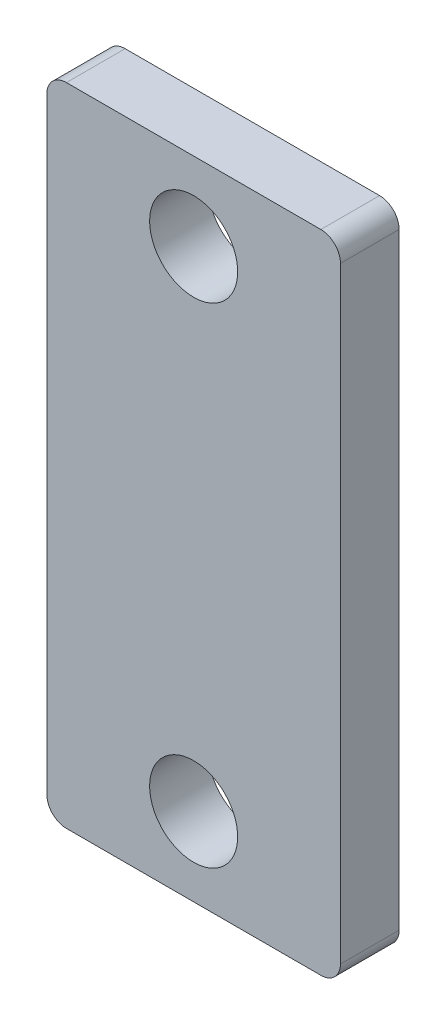
ISO-10303-21;
HEADER;
FILE_DESCRIPTION(('STEP AP214'),'2;1');
FILE_NAME('part.step','',(''),(''),'','','');
FILE_SCHEMA(('AUTOMOTIVE_DESIGN { 1 0 10303 214 1 1 1 1 }'));
ENDSEC;
DATA;
#1=APPLICATION_CONTEXT('core data for automotive mechanical design processes');
#2=APPLICATION_PROTOCOL_DEFINITION('international standard','automotive_design',2000,#1);
#3=PRODUCT_CONTEXT('',#1,'mechanical');
#4=PRODUCT('Part','Part','',(#3));
#5=PRODUCT_RELATED_PRODUCT_CATEGORY('part','',(#4));
#6=PRODUCT_DEFINITION_FORMATION('','',#4);
#7=PRODUCT_DEFINITION_CONTEXT('part definition',#1,'design');
#8=PRODUCT_DEFINITION('design','',#6,#7);
#9=PRODUCT_DEFINITION_SHAPE('','',#8);
#10=(LENGTH_UNIT() NAMED_UNIT(*) SI_UNIT(.MILLI.,.METRE.));
#11=(NAMED_UNIT(*) PLANE_ANGLE_UNIT() SI_UNIT($,.RADIAN.));
#12=(NAMED_UNIT(*) SI_UNIT($,.STERADIAN.) SOLID_ANGLE_UNIT());
#13=UNCERTAINTY_MEASURE_WITH_UNIT(LENGTH_MEASURE(1.E-05),#10,'distance_accuracy_value','');
#14=(GEOMETRIC_REPRESENTATION_CONTEXT(3) GLOBAL_UNCERTAINTY_ASSIGNED_CONTEXT((#13)) GLOBAL_UNIT_ASSIGNED_CONTEXT((#10,
#11,#12)) REPRESENTATION_CONTEXT('',''));
#15=CARTESIAN_POINT('',(0.,0.,0.));
#16=DIRECTION('',(0.,0.,1.));
#17=DIRECTION('',(1.,0.,0.));
#18=AXIS2_PLACEMENT_3D('',#15,#16,#17);
#19=CARTESIAN_POINT('',(0.,41.677288470691,-2.5));
#20=DIRECTION('',(0.,0.,-1.));
#21=DIRECTION('',(-1.,0.,0.));
#22=AXIS2_PLACEMENT_3D('',#19,#20,#21);
#23=PLANE('',#22);
#24=CARTESIAN_POINT('',(0.,41.677288470691,-2.49999999999773));
#25=DIRECTION('',(0.,0.,1.));
#26=DIRECTION('',(1.,0.,0.));
#27=AXIS2_PLACEMENT_3D('',#24,#25,#26);
#28=CIRCLE('',#27,0.749999999982264);
#29=CARTESIAN_POINT('',(0.749999999982265,41.677288470691,-2.49999999999773));
#30=VERTEX_POINT('',#29);
#31=EDGE_CURVE('E277',#30,#30,#28,.T.);
#32=ORIENTED_EDGE('',*,*,#31,.F.);
#33=EDGE_LOOP('',(#32));
#34=FACE_BOUND('',#33,.T.);
#35=ADVANCED_FACE('F16',(#34),#23,.T.);
#36=CARTESIAN_POINT('',(0.,29.677288470691,-2.5));
#37=DIRECTION('',(0.,0.,-1.));
#38=DIRECTION('',(-1.,0.,0.));
#39=AXIS2_PLACEMENT_3D('',#36,#37,#38);
#40=PLANE('',#39);
#41=CARTESIAN_POINT('',(0.,29.677288470691,-2.49999999999773));
#42=DIRECTION('',(0.,0.,1.));
#43=DIRECTION('',(1.,0.,0.));
#44=AXIS2_PLACEMENT_3D('',#41,#42,#43);
#45=CIRCLE('',#44,0.749999999925421);
#46=CARTESIAN_POINT('',(0.749999999925421,29.677288470691,-2.49999999999773));
#47=VERTEX_POINT('',#46);
#48=EDGE_CURVE('E273',#47,#47,#45,.T.);
#49=ORIENTED_EDGE('',*,*,#48,.F.);
#50=EDGE_LOOP('',(#49));
#51=FACE_BOUND('',#50,.T.);
#52=ADVANCED_FACE('F285',(#51),#40,.T.);
#53=CARTESIAN_POINT('',(0.,41.677288470691,-2.25000000011732));
#54=DIRECTION('',(0.,0.,1.));
#55=DIRECTION('',(1.,0.,0.));
#56=AXIS2_PLACEMENT_3D('',#53,#54,#55);
#57=CONICAL_SURFACE('',#56,0.999999999862665,0.785398163397448);
#58=CARTESIAN_POINT('',(0.,41.677288470691,-2.25));
#59=DIRECTION('',(0.,0.,1.));
#60=DIRECTION('',(1.,0.,0.));
#61=AXIS2_PLACEMENT_3D('',#58,#59,#60);
#62=CIRCLE('',#61,1.);
#63=CARTESIAN_POINT('',(1.,41.677288470691,-2.25));
#64=VERTEX_POINT('',#63);
#65=EDGE_CURVE('E276',#64,#64,#62,.T.);
#66=ORIENTED_EDGE('',*,*,#65,.F.);
#67=EDGE_LOOP('',(#66));
#68=FACE_BOUND('',#67,.T.);
#69=ORIENTED_EDGE('',*,*,#31,.T.);
#70=EDGE_LOOP('',(#69));
#71=FACE_BOUND('',#70,.T.);
#72=ADVANCED_FACE('F282',(#68,#71),#57,.T.);
#73=CARTESIAN_POINT('',(0.,29.677288470691,-2.25000000006048));
#74=DIRECTION('',(0.,0.,1.));
#75=DIRECTION('',(1.,0.,0.));
#76=AXIS2_PLACEMENT_3D('',#73,#74,#75);
#77=CONICAL_SURFACE('',#76,0.999999999862665,0.785398163397448);
#78=CARTESIAN_POINT('',(0.,29.677288470691,-2.25));
#79=DIRECTION('',(0.,0.,1.));
#80=DIRECTION('',(1.,0.,0.));
#81=AXIS2_PLACEMENT_3D('',#78,#79,#80);
#82=CIRCLE('',#81,1.);
#83=CARTESIAN_POINT('',(1.,29.677288470691,-2.25));
#84=VERTEX_POINT('',#83);
#85=EDGE_CURVE('E481',#84,#84,#82,.T.);
#86=ORIENTED_EDGE('',*,*,#85,.F.);
#87=EDGE_LOOP('',(#86));
#88=FACE_BOUND('',#87,.T.);
#89=ORIENTED_EDGE('',*,*,#48,.T.);
#90=EDGE_LOOP('',(#89));
#91=FACE_BOUND('',#90,.T.);
#92=ADVANCED_FACE('F364',(#88,#91),#77,.T.);
#93=CARTESIAN_POINT('',(0.,41.677288470691,-2.5));
#94=DIRECTION('',(0.,0.,1.));
#95=DIRECTION('',(1.,0.,0.));
#96=AXIS2_PLACEMENT_3D('',#93,#94,#95);
#97=CYLINDRICAL_SURFACE('',#96,1.);
#98=CARTESIAN_POINT('',(0.,41.677288470691,-0.5));
#99=DIRECTION('',(0.,0.,1.));
#100=DIRECTION('',(1.,0.,0.));
#101=AXIS2_PLACEMENT_3D('',#98,#99,#100);
#102=CIRCLE('',#101,1.);
#103=CARTESIAN_POINT('',(1.,41.677288470691,-0.5));
#104=VERTEX_POINT('',#103);
#105=EDGE_CURVE('E485',#104,#104,#102,.F.);
#106=ORIENTED_EDGE('',*,*,#105,.T.);
#107=EDGE_LOOP('',(#106));
#108=FACE_BOUND('',#107,.T.);
#109=ORIENTED_EDGE('',*,*,#65,.T.);
#110=EDGE_LOOP('',(#109));
#111=FACE_BOUND('',#110,.T.);
#112=ADVANCED_FACE('F357',(#108,#111),#97,.T.);
#113=CARTESIAN_POINT('',(0.,29.677288470691,-2.5));
#114=DIRECTION('',(0.,0.,1.));
#115=DIRECTION('',(1.,0.,0.));
#116=AXIS2_PLACEMENT_3D('',#113,#114,#115);
#117=CYLINDRICAL_SURFACE('',#116,1.);
#118=CARTESIAN_POINT('',(0.,29.677288470691,-0.5));
#119=DIRECTION('',(0.,0.,1.));
#120=DIRECTION('',(1.,0.,0.));
#121=AXIS2_PLACEMENT_3D('',#118,#119,#120);
#122=CIRCLE('',#121,1.);
#123=CARTESIAN_POINT('',(1.,29.677288470691,-0.5));
#124=VERTEX_POINT('',#123);
#125=EDGE_CURVE('E272',#124,#124,#122,.F.);
#126=ORIENTED_EDGE('',*,*,#125,.T.);
#127=EDGE_LOOP('',(#126));
#128=FACE_BOUND('',#127,.T.);
#129=ORIENTED_EDGE('',*,*,#85,.T.);
#130=EDGE_LOOP('',(#129));
#131=FACE_BOUND('',#130,.T.);
#132=ADVANCED_FACE('F351',(#128,#131),#117,.T.);
#133=CARTESIAN_POINT('',(0.,41.677288470691,-0.5));
#134=DIRECTION('',(0.,0.,1.));
#135=DIRECTION('',(1.,0.,0.));
#136=AXIS2_PLACEMENT_3D('',#133,#134,#135);
#137=TOROIDAL_SURFACE('',#136,1.5,0.5);
#138=CARTESIAN_POINT('',(0.,41.677288470691,0.));
#139=DIRECTION('',(0.,0.,-1.));
#140=DIRECTION('',(-1.,0.,0.));
#141=AXIS2_PLACEMENT_3D('',#138,#139,#140);
#142=CIRCLE('',#141,1.5);
#143=CARTESIAN_POINT('',(-1.5,41.677288470691,0.));
#144=VERTEX_POINT('',#143);
#145=CARTESIAN_POINT('',(1.5,41.677288470691,0.));
#146=VERTEX_POINT('',#145);
#147=EDGE_CURVE('E247',#144,#146,#142,.T.);
#148=ORIENTED_EDGE('',*,*,#147,.T.);
#149=CARTESIAN_POINT('',(0.,41.677288470691,0.));
#150=DIRECTION('',(0.,0.,-1.));
#151=DIRECTION('',(1.,0.,0.));
#152=AXIS2_PLACEMENT_3D('',#149,#150,#151);
#153=CIRCLE('',#152,1.5);
#154=EDGE_CURVE('E95',#146,#144,#153,.T.);
#155=ORIENTED_EDGE('',*,*,#154,.T.);
#156=EDGE_LOOP('',(#148,#155));
#157=FACE_BOUND('',#156,.T.);
#158=ORIENTED_EDGE('',*,*,#105,.F.);
#159=EDGE_LOOP('',(#158));
#160=FACE_BOUND('',#159,.T.);
#161=ADVANCED_FACE('F223',(#157,#160),#137,.F.);
#162=CARTESIAN_POINT('',(0.,29.677288470691,-0.5));
#163=DIRECTION('',(0.,0.,1.));
#164=DIRECTION('',(1.,0.,0.));
#165=AXIS2_PLACEMENT_3D('',#162,#163,#164);
#166=TOROIDAL_SURFACE('',#165,1.5,0.5);
#167=CARTESIAN_POINT('',(0.,29.677288470691,0.));
#168=DIRECTION('',(0.,0.,-1.));
#169=DIRECTION('',(-1.,0.,0.));
#170=AXIS2_PLACEMENT_3D('',#167,#168,#169);
#171=CIRCLE('',#170,1.5);
#172=CARTESIAN_POINT('',(-1.5,29.677288470691,0.));
#173=VERTEX_POINT('',#172);
#174=CARTESIAN_POINT('',(1.5,29.677288470691,0.));
#175=VERTEX_POINT('',#174);
#176=EDGE_CURVE('E195',#173,#175,#171,.T.);
#177=ORIENTED_EDGE('',*,*,#176,.T.);
#178=CARTESIAN_POINT('',(0.,29.677288470691,0.));
#179=DIRECTION('',(0.,0.,-1.));
#180=DIRECTION('',(1.,0.,0.));
#181=AXIS2_PLACEMENT_3D('',#178,#179,#180);
#182=CIRCLE('',#181,1.5);
#183=EDGE_CURVE('E253',#175,#173,#182,.T.);
#184=ORIENTED_EDGE('',*,*,#183,.T.);
#185=EDGE_LOOP('',(#177,#184));
#186=FACE_BOUND('',#185,.T.);
#187=ORIENTED_EDGE('',*,*,#125,.F.);
#188=EDGE_LOOP('',(#187));
#189=FACE_BOUND('',#188,.T.);
#190=ADVANCED_FACE('F218',(#186,#189),#166,.F.);
#191=CARTESIAN_POINT('',(-6.49999999999999,20.177288470691,3.));
#192=DIRECTION('',(0.,0.,1.));
#193=DIRECTION('',(1.,0.,0.));
#194=AXIS2_PLACEMENT_3D('',#191,#192,#193);
#195=CYLINDRICAL_SURFACE('',#194,1.);
#196=CARTESIAN_POINT('',(-6.49999999999999,20.177288470691,3.));
#197=DIRECTION('',(0.,0.,1.));
#198=DIRECTION('',(1.,0.,0.));
#199=AXIS2_PLACEMENT_3D('',#196,#197,#198);
#200=CIRCLE('',#199,1.);
#201=CARTESIAN_POINT('',(-6.49999999999999,19.177288470691,3.));
#202=VERTEX_POINT('',#201);
#203=CARTESIAN_POINT('',(-7.49999999999999,20.177288470691,3.));
#204=VERTEX_POINT('',#203);
#205=EDGE_CURVE('E57',#202,#204,#200,.F.);
#206=ORIENTED_EDGE('',*,*,#205,.T.);
#207=DIRECTION('',(0.,0.,1.));
#208=VECTOR('',#207,1.);
#209=CARTESIAN_POINT('',(-7.49999999999999,20.177288470691,3.));
#210=LINE('',#209,#208);
#211=CARTESIAN_POINT('',(-7.49999999999999,20.177288470691,0.));
#212=VERTEX_POINT('',#211);
#213=EDGE_CURVE('E145',#204,#212,#210,.F.);
#214=ORIENTED_EDGE('',*,*,#213,.T.);
#215=CARTESIAN_POINT('',(-6.49999999999999,20.177288470691,0.));
#216=DIRECTION('',(0.,0.,1.));
#217=DIRECTION('',(1.,0.,0.));
#218=AXIS2_PLACEMENT_3D('',#215,#216,#217);
#219=CIRCLE('',#218,1.);
#220=CARTESIAN_POINT('',(-6.49999999999999,19.177288470691,0.));
#221=VERTEX_POINT('',#220);
#222=EDGE_CURVE('E146',#212,#221,#219,.T.);
#223=ORIENTED_EDGE('',*,*,#222,.T.);
#224=DIRECTION('',(0.,0.,1.));
#225=VECTOR('',#224,1.);
#226=CARTESIAN_POINT('',(-6.49999999999999,19.177288470691,-2.5));
#227=LINE('',#226,#225);
#228=EDGE_CURVE('E106',#221,#202,#227,.T.);
#229=ORIENTED_EDGE('',*,*,#228,.T.);
#230=EDGE_LOOP('',(#206,#214,#223,#229));
#231=FACE_BOUND('',#230,.T.);
#232=ADVANCED_FACE('F222',(#231),#195,.T.);
#233=CARTESIAN_POINT('',(6.50000000000001,20.177288470691,3.));
#234=DIRECTION('',(0.,0.,-1.));
#235=DIRECTION('',(-1.,0.,0.));
#236=AXIS2_PLACEMENT_3D('',#233,#234,#235);
#237=CYLINDRICAL_SURFACE('',#236,1.);
#238=CARTESIAN_POINT('',(6.50000000000001,20.177288470691,0.));
#239=DIRECTION('',(0.,0.,-1.));
#240=DIRECTION('',(-1.,0.,0.));
#241=AXIS2_PLACEMENT_3D('',#238,#239,#240);
#242=CIRCLE('',#241,1.);
#243=CARTESIAN_POINT('',(6.50000000000001,19.177288470691,0.));
#244=VERTEX_POINT('',#243);
#245=CARTESIAN_POINT('',(7.50000000000001,20.177288470691,0.));
#246=VERTEX_POINT('',#245);
#247=EDGE_CURVE('E256',#244,#246,#242,.F.);
#248=ORIENTED_EDGE('',*,*,#247,.T.);
#249=DIRECTION('',(0.,0.,1.));
#250=VECTOR('',#249,1.);
#251=CARTESIAN_POINT('',(7.50000000000001,20.177288470691,3.));
#252=LINE('',#251,#250);
#253=CARTESIAN_POINT('',(7.50000000000001,20.177288470691,3.));
#254=VERTEX_POINT('',#253);
#255=EDGE_CURVE('E132',#246,#254,#252,.T.);
#256=ORIENTED_EDGE('',*,*,#255,.T.);
#257=CARTESIAN_POINT('',(6.50000000000001,20.177288470691,3.));
#258=DIRECTION('',(0.,0.,-1.));
#259=DIRECTION('',(-1.,0.,0.));
#260=AXIS2_PLACEMENT_3D('',#257,#258,#259);
#261=CIRCLE('',#260,1.);
#262=CARTESIAN_POINT('',(6.50000000000001,19.177288470691,3.));
#263=VERTEX_POINT('',#262);
#264=EDGE_CURVE('E109',#254,#263,#261,.T.);
#265=ORIENTED_EDGE('',*,*,#264,.T.);
#266=DIRECTION('',(0.,0.,1.));
#267=VECTOR('',#266,1.);
#268=CARTESIAN_POINT('',(6.50000000000001,19.177288470691,-2.5));
#269=LINE('',#268,#267);
#270=EDGE_CURVE('E138',#263,#244,#269,.F.);
#271=ORIENTED_EDGE('',*,*,#270,.T.);
#272=EDGE_LOOP('',(#248,#256,#265,#271));
#273=FACE_BOUND('',#272,.T.);
#274=ADVANCED_FACE('F330',(#273),#237,.T.);
#275=CARTESIAN_POINT('',(-6.5,51.177288470691,-2.5));
#276=DIRECTION('',(0.,0.,1.));
#277=DIRECTION('',(1.,0.,0.));
#278=AXIS2_PLACEMENT_3D('',#275,#276,#277);
#279=CYLINDRICAL_SURFACE('',#278,1.);
#280=CARTESIAN_POINT('',(-6.5,51.177288470691,3.));
#281=DIRECTION('',(0.,0.,1.));
#282=DIRECTION('',(1.,0.,0.));
#283=AXIS2_PLACEMENT_3D('',#280,#281,#282);
#284=CIRCLE('',#283,1.);
#285=CARTESIAN_POINT('',(-7.5,51.177288470691,3.));
#286=VERTEX_POINT('',#285);
#287=CARTESIAN_POINT('',(-6.5,52.177288470691,3.));
#288=VERTEX_POINT('',#287);
#289=EDGE_CURVE('E37',#286,#288,#284,.F.);
#290=ORIENTED_EDGE('',*,*,#289,.T.);
#291=DIRECTION('',(0.,0.,-1.));
#292=VECTOR('',#291,1.);
#293=CARTESIAN_POINT('',(-6.5,52.177288470691,-2.5));
#294=LINE('',#293,#292);
#295=CARTESIAN_POINT('',(-6.5,52.177288470691,0.));
#296=VERTEX_POINT('',#295);
#297=EDGE_CURVE('E129',#288,#296,#294,.T.);
#298=ORIENTED_EDGE('',*,*,#297,.T.);
#299=CARTESIAN_POINT('',(-6.5,51.177288470691,0.));
#300=DIRECTION('',(0.,0.,1.));
#301=DIRECTION('',(1.,0.,0.));
#302=AXIS2_PLACEMENT_3D('',#299,#300,#301);
#303=CIRCLE('',#302,1.);
#304=CARTESIAN_POINT('',(-7.5,51.177288470691,0.));
#305=VERTEX_POINT('',#304);
#306=EDGE_CURVE('E262',#296,#305,#303,.T.);
#307=ORIENTED_EDGE('',*,*,#306,.T.);
#308=DIRECTION('',(0.,0.,1.));
#309=VECTOR('',#308,1.);
#310=CARTESIAN_POINT('',(-7.5,51.177288470691,3.));
#311=LINE('',#310,#309);
#312=EDGE_CURVE('E142',#305,#286,#311,.T.);
#313=ORIENTED_EDGE('',*,*,#312,.T.);
#314=EDGE_LOOP('',(#290,#298,#307,#313));
#315=FACE_BOUND('',#314,.T.);
#316=ADVANCED_FACE('F332',(#315),#279,.T.);
#317=CARTESIAN_POINT('',(6.50000000000001,51.177288470691,3.));
#318=DIRECTION('',(0.,0.,1.));
#319=DIRECTION('',(1.,0.,0.));
#320=AXIS2_PLACEMENT_3D('',#317,#318,#319);
#321=CYLINDRICAL_SURFACE('',#320,1.);
#322=CARTESIAN_POINT('',(6.50000000000001,51.177288470691,3.));
#323=DIRECTION('',(0.,0.,1.));
#324=DIRECTION('',(1.,0.,0.));
#325=AXIS2_PLACEMENT_3D('',#322,#323,#324);
#326=CIRCLE('',#325,1.);
#327=CARTESIAN_POINT('',(6.50000000000001,52.177288470691,3.));
#328=VERTEX_POINT('',#327);
#329=CARTESIAN_POINT('',(7.50000000000001,51.177288470691,3.));
#330=VERTEX_POINT('',#329);
#331=EDGE_CURVE('E86',#328,#330,#326,.F.);
#332=ORIENTED_EDGE('',*,*,#331,.T.);
#333=DIRECTION('',(0.,0.,1.));
#334=VECTOR('',#333,1.);
#335=CARTESIAN_POINT('',(7.50000000000001,51.177288470691,3.));
#336=LINE('',#335,#334);
#337=CARTESIAN_POINT('',(7.50000000000001,51.177288470691,0.));
#338=VERTEX_POINT('',#337);
#339=EDGE_CURVE('E89',#330,#338,#336,.F.);
#340=ORIENTED_EDGE('',*,*,#339,.T.);
#341=CARTESIAN_POINT('',(6.50000000000001,51.177288470691,0.));
#342=DIRECTION('',(0.,0.,1.));
#343=DIRECTION('',(1.,0.,0.));
#344=AXIS2_PLACEMENT_3D('',#341,#342,#343);
#345=CIRCLE('',#344,1.);
#346=CARTESIAN_POINT('',(6.50000000000001,52.177288470691,0.));
#347=VERTEX_POINT('',#346);
#348=EDGE_CURVE('E71',#338,#347,#345,.T.);
#349=ORIENTED_EDGE('',*,*,#348,.T.);
#350=DIRECTION('',(0.,0.,-1.));
#351=VECTOR('',#350,1.);
#352=CARTESIAN_POINT('',(6.50000000000001,52.177288470691,-2.5));
#353=LINE('',#352,#351);
#354=EDGE_CURVE('E91',#347,#328,#353,.F.);
#355=ORIENTED_EDGE('',*,*,#354,.T.);
#356=EDGE_LOOP('',(#332,#340,#349,#355));
#357=FACE_BOUND('',#356,.T.);
#358=ADVANCED_FACE('F88',(#357),#321,.T.);
#359=CARTESIAN_POINT('',(0.,0.,0.));
#360=DIRECTION('',(0.,0.,1.));
#361=DIRECTION('',(1.,0.,0.));
#362=AXIS2_PLACEMENT_3D('',#359,#360,#361);
#363=PLANE('',#362);
#364=CARTESIAN_POINT('',(0.,48.177288470691,0.));
#365=DIRECTION('',(0.,0.,-1.));
#366=DIRECTION('',(-1.,0.,0.));
#367=AXIS2_PLACEMENT_3D('',#364,#365,#366);
#368=CIRCLE('',#367,2.25);
#369=CARTESIAN_POINT('',(-2.24999999999999,48.177288470691,0.));
#370=VERTEX_POINT('',#369);
#371=EDGE_CURVE('E124',#370,#370,#368,.F.);
#372=ORIENTED_EDGE('',*,*,#371,.T.);
#373=EDGE_LOOP('',(#372));
#374=FACE_BOUND('',#373,.T.);
#375=ORIENTED_EDGE('',*,*,#222,.F.);
#376=DIRECTION('',(0.,1.,0.));
#377=VECTOR('',#376,1.);
#378=CARTESIAN_POINT('',(-7.5,53.177288470691,0.));
#379=LINE('',#378,#377);
#380=EDGE_CURVE('E141',#212,#305,#379,.T.);
#381=ORIENTED_EDGE('',*,*,#380,.T.);
#382=ORIENTED_EDGE('',*,*,#306,.F.);
#383=DIRECTION('',(1.,0.,0.));
#384=VECTOR('',#383,1.);
#385=CARTESIAN_POINT('',(-7.5,52.177288470691,0.));
#386=LINE('',#385,#384);
#387=EDGE_CURVE('E128',#296,#347,#386,.T.);
#388=ORIENTED_EDGE('',*,*,#387,.T.);
#389=ORIENTED_EDGE('',*,*,#348,.F.);
#390=DIRECTION('',(0.,-1.,0.));
#391=VECTOR('',#390,1.);
#392=CARTESIAN_POINT('',(7.50000000000001,18.177288470691,0.));
#393=LINE('',#392,#391);
#394=EDGE_CURVE('E104',#338,#246,#393,.T.);
#395=ORIENTED_EDGE('',*,*,#394,.T.);
#396=ORIENTED_EDGE('',*,*,#247,.F.);
#397=DIRECTION('',(-1.,0.,0.));
#398=VECTOR('',#397,1.);
#399=CARTESIAN_POINT('',(7.50000000000001,19.177288470691,0.));
#400=LINE('',#399,#398);
#401=EDGE_CURVE('E137',#244,#221,#400,.T.);
#402=ORIENTED_EDGE('',*,*,#401,.T.);
#403=EDGE_LOOP('',(#375,#381,#382,#388,#389,#395,#396,#402));
#404=FACE_BOUND('',#403,.T.);
#405=CARTESIAN_POINT('',(0.,23.177288470691,0.));
#406=DIRECTION('',(0.,0.,-1.));
#407=DIRECTION('',(-1.,0.,0.));
#408=AXIS2_PLACEMENT_3D('',#405,#406,#407);
#409=CIRCLE('',#408,2.25);
#410=CARTESIAN_POINT('',(-2.24999999999999,23.177288470691,0.));
#411=VERTEX_POINT('',#410);
#412=EDGE_CURVE('E127',#411,#411,#409,.F.);
#413=ORIENTED_EDGE('',*,*,#412,.T.);
#414=EDGE_LOOP('',(#413));
#415=FACE_BOUND('',#414,.T.);
#416=ORIENTED_EDGE('',*,*,#183,.F.);
#417=ORIENTED_EDGE('',*,*,#176,.F.);
#418=EDGE_LOOP('',(#416,#417));
#419=FACE_BOUND('',#418,.T.);
#420=ORIENTED_EDGE('',*,*,#154,.F.);
#421=ORIENTED_EDGE('',*,*,#147,.F.);
#422=EDGE_LOOP('',(#420,#421));
#423=FACE_BOUND('',#422,.T.);
#424=ADVANCED_FACE('F160',(#374,#404,#415,#419,#423),#363,.F.);
#425=CARTESIAN_POINT('',(-7.5,53.177288470691,3.));
#426=DIRECTION('',(1.,0.,0.));
#427=DIRECTION('',(0.,1.,0.));
#428=AXIS2_PLACEMENT_3D('',#425,#426,#427);
#429=PLANE('',#428);
#430=ORIENTED_EDGE('',*,*,#213,.F.);
#431=DIRECTION('',(0.,1.,0.));
#432=VECTOR('',#431,1.);
#433=CARTESIAN_POINT('',(-7.5,0.,3.));
#434=LINE('',#433,#432);
#435=EDGE_CURVE('E119',#286,#204,#434,.F.);
#436=ORIENTED_EDGE('',*,*,#435,.F.);
#437=ORIENTED_EDGE('',*,*,#312,.F.);
#438=ORIENTED_EDGE('',*,*,#380,.F.);
#439=EDGE_LOOP('',(#430,#436,#437,#438));
#440=FACE_BOUND('',#439,.T.);
#441=ADVANCED_FACE('F170',(#440),#429,.F.);
#442=CARTESIAN_POINT('',(7.50000000000001,19.177288470691,-2.5));
#443=DIRECTION('',(0.,1.,0.));
#444=DIRECTION('',(-1.,0.,0.));
#445=AXIS2_PLACEMENT_3D('',#442,#443,#444);
#446=PLANE('',#445);
#447=ORIENTED_EDGE('',*,*,#228,.F.);
#448=ORIENTED_EDGE('',*,*,#401,.F.);
#449=ORIENTED_EDGE('',*,*,#270,.F.);
#450=DIRECTION('',(1.,0.,0.));
#451=VECTOR('',#450,1.);
#452=CARTESIAN_POINT('',(0.,19.177288470691,3.));
#453=LINE('',#452,#451);
#454=EDGE_CURVE('E113',#202,#263,#453,.T.);
#455=ORIENTED_EDGE('',*,*,#454,.F.);
#456=EDGE_LOOP('',(#447,#448,#449,#455));
#457=FACE_BOUND('',#456,.T.);
#458=ADVANCED_FACE('F311',(#457),#446,.F.);
#459=CARTESIAN_POINT('',(7.50000000000001,18.177288470691,3.));
#460=DIRECTION('',(-1.,0.,0.));
#461=DIRECTION('',(0.,-1.,0.));
#462=AXIS2_PLACEMENT_3D('',#459,#460,#461);
#463=PLANE('',#462);
#464=ORIENTED_EDGE('',*,*,#255,.F.);
#465=ORIENTED_EDGE('',*,*,#394,.F.);
#466=ORIENTED_EDGE('',*,*,#339,.F.);
#467=DIRECTION('',(0.,1.,0.));
#468=VECTOR('',#467,1.);
#469=CARTESIAN_POINT('',(7.50000000000001,0.,3.));
#470=LINE('',#469,#468);
#471=EDGE_CURVE('E102',#254,#330,#470,.T.);
#472=ORIENTED_EDGE('',*,*,#471,.F.);
#473=EDGE_LOOP('',(#464,#465,#466,#472));
#474=FACE_BOUND('',#473,.T.);
#475=ADVANCED_FACE('F101',(#474),#463,.F.);
#476=CARTESIAN_POINT('',(-7.5,52.177288470691,-2.5));
#477=DIRECTION('',(0.,-1.,0.));
#478=DIRECTION('',(0.,0.,-1.));
#479=AXIS2_PLACEMENT_3D('',#476,#477,#478);
#480=PLANE('',#479);
#481=ORIENTED_EDGE('',*,*,#354,.F.);
#482=ORIENTED_EDGE('',*,*,#387,.F.);
#483=ORIENTED_EDGE('',*,*,#297,.F.);
#484=DIRECTION('',(1.,0.,0.));
#485=VECTOR('',#484,1.);
#486=CARTESIAN_POINT('',(0.,52.177288470691,3.));
#487=LINE('',#486,#485);
#488=EDGE_CURVE('E112',#328,#288,#487,.F.);
#489=ORIENTED_EDGE('',*,*,#488,.F.);
#490=EDGE_LOOP('',(#481,#482,#483,#489));
#491=FACE_BOUND('',#490,.T.);
#492=ADVANCED_FACE('F305',(#491),#480,.F.);
#493=CARTESIAN_POINT('',(0.,23.177288470691,3.));
#494=DIRECTION('',(0.,0.,-1.));
#495=DIRECTION('',(-1.,0.,0.));
#496=AXIS2_PLACEMENT_3D('',#493,#494,#495);
#497=CYLINDRICAL_SURFACE('',#496,2.25);
#498=CARTESIAN_POINT('',(0.,23.177288470691,3.));
#499=DIRECTION('',(0.,0.,-1.));
#500=DIRECTION('',(-1.,0.,0.));
#501=AXIS2_PLACEMENT_3D('',#498,#499,#500);
#502=CIRCLE('',#501,2.25);
#503=CARTESIAN_POINT('',(-2.24999999999999,23.177288470691,3.));
#504=VERTEX_POINT('',#503);
#505=EDGE_CURVE('E28',#504,#504,#502,.T.);
#506=ORIENTED_EDGE('',*,*,#505,.F.);
#507=EDGE_LOOP('',(#506));
#508=FACE_BOUND('',#507,.T.);
#509=ORIENTED_EDGE('',*,*,#412,.F.);
#510=EDGE_LOOP('',(#509));
#511=FACE_BOUND('',#510,.T.);
#512=ADVANCED_FACE('F298',(#508,#511),#497,.F.);
#513=CARTESIAN_POINT('',(0.,48.177288470691,3.));
#514=DIRECTION('',(0.,0.,-1.));
#515=DIRECTION('',(-1.,0.,0.));
#516=AXIS2_PLACEMENT_3D('',#513,#514,#515);
#517=CYLINDRICAL_SURFACE('',#516,2.25);
#518=CARTESIAN_POINT('',(0.,48.177288470691,3.));
#519=DIRECTION('',(0.,0.,-1.));
#520=DIRECTION('',(-1.,0.,0.));
#521=AXIS2_PLACEMENT_3D('',#518,#519,#520);
#522=CIRCLE('',#521,2.25);
#523=CARTESIAN_POINT('',(-2.24999999999999,48.177288470691,3.));
#524=VERTEX_POINT('',#523);
#525=EDGE_CURVE('E11',#524,#524,#522,.T.);
#526=ORIENTED_EDGE('',*,*,#525,.F.);
#527=EDGE_LOOP('',(#526));
#528=FACE_BOUND('',#527,.T.);
#529=ORIENTED_EDGE('',*,*,#371,.F.);
#530=EDGE_LOOP('',(#529));
#531=FACE_BOUND('',#530,.T.);
#532=ADVANCED_FACE('F292',(#528,#531),#517,.F.);
#533=CARTESIAN_POINT('',(0.,0.,3.));
#534=DIRECTION('',(0.,0.,1.));
#535=DIRECTION('',(1.,0.,0.));
#536=AXIS2_PLACEMENT_3D('',#533,#534,#535);
#537=PLANE('',#536);
#538=ORIENTED_EDGE('',*,*,#525,.T.);
#539=EDGE_LOOP('',(#538));
#540=FACE_BOUND('',#539,.T.);
#541=ORIENTED_EDGE('',*,*,#505,.T.);
#542=EDGE_LOOP('',(#541));
#543=FACE_BOUND('',#542,.T.);
#544=ORIENTED_EDGE('',*,*,#488,.T.);
#545=ORIENTED_EDGE('',*,*,#289,.F.);
#546=ORIENTED_EDGE('',*,*,#435,.T.);
#547=ORIENTED_EDGE('',*,*,#205,.F.);
#548=ORIENTED_EDGE('',*,*,#454,.T.);
#549=ORIENTED_EDGE('',*,*,#264,.F.);
#550=ORIENTED_EDGE('',*,*,#471,.T.);
#551=ORIENTED_EDGE('',*,*,#331,.F.);
#552=EDGE_LOOP('',(#544,#545,#546,#547,#548,#549,#550,#551));
#553=FACE_BOUND('',#552,.T.);
#554=ADVANCED_FACE('F108',(#540,#543,#553),#537,.T.);
#555=CLOSED_SHELL('',(#35,#52,#72,#92,#112,#132,#161,#190,#232,#274,#316,#358,#424,#441,#458,
#475,#492,#512,#532,#554));
#556=MANIFOLD_SOLID_BREP('B1',#555);
#557=ADVANCED_BREP_SHAPE_REPRESENTATION('',(#18,#556),#14);
#558=SHAPE_DEFINITION_REPRESENTATION(#9,#557);
ENDSEC;
END-ISO-10303-21;
